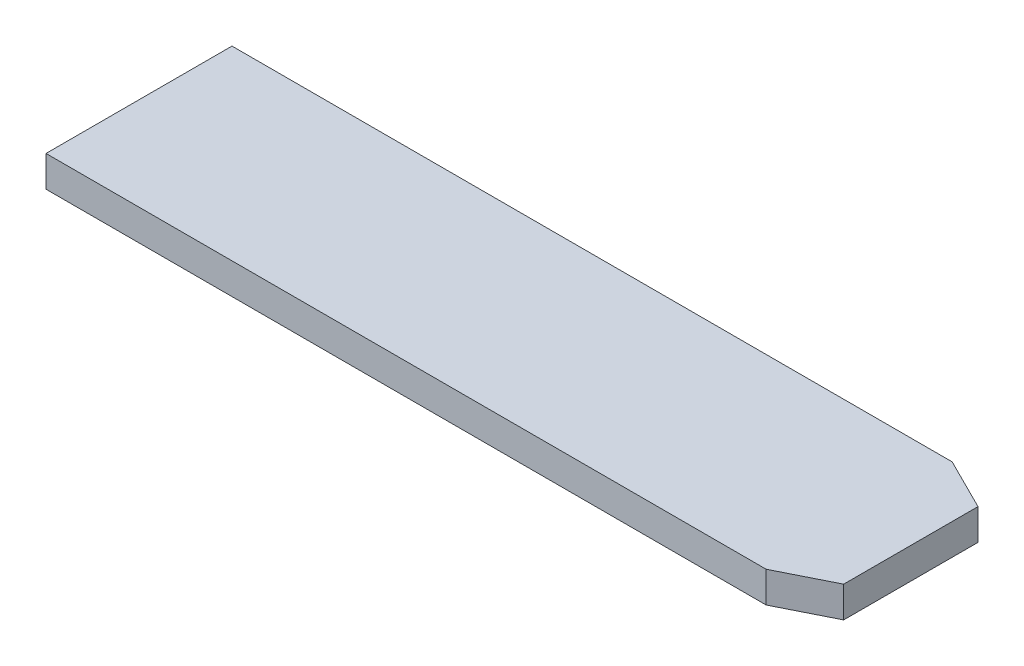
ISO-10303-21;
HEADER;
FILE_DESCRIPTION(('STEP AP214'),'2;1');
FILE_NAME('part.step','',(''),(''),'','','');
FILE_SCHEMA(('AUTOMOTIVE_DESIGN { 1 0 10303 214 1 1 1 1 }'));
ENDSEC;
DATA;
#1=APPLICATION_CONTEXT('core data for automotive mechanical design processes');
#2=APPLICATION_PROTOCOL_DEFINITION('international standard','automotive_design',2000,#1);
#3=PRODUCT_CONTEXT('',#1,'mechanical');
#4=PRODUCT('Part','Part','',(#3));
#5=PRODUCT_RELATED_PRODUCT_CATEGORY('part','',(#4));
#6=PRODUCT_DEFINITION_FORMATION('','',#4);
#7=PRODUCT_DEFINITION_CONTEXT('part definition',#1,'design');
#8=PRODUCT_DEFINITION('design','',#6,#7);
#9=PRODUCT_DEFINITION_SHAPE('','',#8);
#10=(LENGTH_UNIT() NAMED_UNIT(*) SI_UNIT(.MILLI.,.METRE.));
#11=(NAMED_UNIT(*) PLANE_ANGLE_UNIT() SI_UNIT($,.RADIAN.));
#12=(NAMED_UNIT(*) SI_UNIT($,.STERADIAN.) SOLID_ANGLE_UNIT());
#13=UNCERTAINTY_MEASURE_WITH_UNIT(LENGTH_MEASURE(1.E-05),#10,'distance_accuracy_value','');
#14=(GEOMETRIC_REPRESENTATION_CONTEXT(3) GLOBAL_UNCERTAINTY_ASSIGNED_CONTEXT((#13)) GLOBAL_UNIT_ASSIGNED_CONTEXT((#10,
#11,#12)) REPRESENTATION_CONTEXT('',''));
#15=CARTESIAN_POINT('',(0.,0.,0.));
#16=DIRECTION('',(0.,0.,1.));
#17=DIRECTION('',(1.,0.,0.));
#18=AXIS2_PLACEMENT_3D('',#15,#16,#17);
#19=CARTESIAN_POINT('',(-34.85,3.,-9.));
#20=DIRECTION('',(1.,0.,0.));
#21=DIRECTION('',(0.,0.,-1.));
#22=AXIS2_PLACEMENT_3D('',#19,#20,#21);
#23=PLANE('',#22);
#24=DIRECTION('',(0.,0.,1.));
#25=VECTOR('',#24,1.);
#26=CARTESIAN_POINT('',(-34.85,0.,-9.));
#27=LINE('',#26,#25);
#28=CARTESIAN_POINT('',(-34.85,0.,-9.));
#29=VERTEX_POINT('',#28);
#30=CARTESIAN_POINT('',(-34.85,0.,9.));
#31=VERTEX_POINT('',#30);
#32=EDGE_CURVE('E93',#29,#31,#27,.T.);
#33=ORIENTED_EDGE('',*,*,#32,.T.);
#34=DIRECTION('',(0.,-1.,0.));
#35=VECTOR('',#34,1.);
#36=CARTESIAN_POINT('',(-34.85,3.,9.));
#37=LINE('',#36,#35);
#38=CARTESIAN_POINT('',(-34.85,3.,9.));
#39=VERTEX_POINT('',#38);
#40=EDGE_CURVE('E12',#39,#31,#37,.T.);
#41=ORIENTED_EDGE('',*,*,#40,.F.);
#42=DIRECTION('',(0.,0.,1.));
#43=VECTOR('',#42,1.);
#44=CARTESIAN_POINT('',(-34.85,3.,-9.));
#45=LINE('',#44,#43);
#46=CARTESIAN_POINT('',(-34.85,3.,-9.));
#47=VERTEX_POINT('',#46);
#48=EDGE_CURVE('E182',#47,#39,#45,.T.);
#49=ORIENTED_EDGE('',*,*,#48,.F.);
#50=DIRECTION('',(0.,-1.,0.));
#51=VECTOR('',#50,1.);
#52=CARTESIAN_POINT('',(-34.85,3.,-9.));
#53=LINE('',#52,#51);
#54=EDGE_CURVE('E185',#47,#29,#53,.T.);
#55=ORIENTED_EDGE('',*,*,#54,.T.);
#56=EDGE_LOOP('',(#33,#41,#49,#55));
#57=FACE_BOUND('',#56,.T.);
#58=ADVANCED_FACE('F44',(#57),#23,.F.);
#59=CARTESIAN_POINT('',(34.85,3.,8.99999999999999));
#60=DIRECTION('',(0.,0.,-1.));
#61=DIRECTION('',(-1.,0.,0.));
#62=AXIS2_PLACEMENT_3D('',#59,#60,#61);
#63=PLANE('',#62);
#64=DIRECTION('',(1.,0.,0.));
#65=VECTOR('',#64,1.);
#66=CARTESIAN_POINT('',(34.85,0.,8.99999999999999));
#67=LINE('',#66,#65);
#68=CARTESIAN_POINT('',(34.85,0.,8.99999999999999));
#69=VERTEX_POINT('',#68);
#70=EDGE_CURVE('E82',#31,#69,#67,.T.);
#71=ORIENTED_EDGE('',*,*,#70,.T.);
#72=DIRECTION('',(0.,1.,0.));
#73=VECTOR('',#72,1.);
#74=CARTESIAN_POINT('',(34.85,0.,8.99999999999999));
#75=LINE('',#74,#73);
#76=CARTESIAN_POINT('',(34.85,3.,8.99999999999999));
#77=VERTEX_POINT('',#76);
#78=EDGE_CURVE('E53',#77,#69,#75,.F.);
#79=ORIENTED_EDGE('',*,*,#78,.F.);
#80=DIRECTION('',(1.,0.,0.));
#81=VECTOR('',#80,1.);
#82=CARTESIAN_POINT('',(34.85,3.,8.99999999999999));
#83=LINE('',#82,#81);
#84=EDGE_CURVE('E189',#39,#77,#83,.T.);
#85=ORIENTED_EDGE('',*,*,#84,.F.);
#86=ORIENTED_EDGE('',*,*,#40,.T.);
#87=EDGE_LOOP('',(#71,#79,#85,#86));
#88=FACE_BOUND('',#87,.T.);
#89=ADVANCED_FACE('F84',(#88),#63,.F.);
#90=CARTESIAN_POINT('',(34.85,3.,-9.00000000000001));
#91=DIRECTION('',(0.,0.,1.));
#92=DIRECTION('',(1.,0.,0.));
#93=AXIS2_PLACEMENT_3D('',#90,#91,#92);
#94=PLANE('',#93);
#95=DIRECTION('',(-1.,0.,0.));
#96=VECTOR('',#95,1.);
#97=CARTESIAN_POINT('',(34.85,0.,-9.00000000000001));
#98=LINE('',#97,#96);
#99=CARTESIAN_POINT('',(34.85,0.,-9.00000000000001));
#100=VERTEX_POINT('',#99);
#101=EDGE_CURVE('E92',#100,#29,#98,.T.);
#102=ORIENTED_EDGE('',*,*,#101,.T.);
#103=ORIENTED_EDGE('',*,*,#54,.F.);
#104=DIRECTION('',(-1.,0.,0.));
#105=VECTOR('',#104,1.);
#106=CARTESIAN_POINT('',(34.85,3.,-9.00000000000001));
#107=LINE('',#106,#105);
#108=CARTESIAN_POINT('',(34.85,3.,-9.00000000000001));
#109=VERTEX_POINT('',#108);
#110=EDGE_CURVE('E62',#109,#47,#107,.T.);
#111=ORIENTED_EDGE('',*,*,#110,.F.);
#112=DIRECTION('',(0.,1.,0.));
#113=VECTOR('',#112,1.);
#114=CARTESIAN_POINT('',(34.85,3.,-9.00000000000001));
#115=LINE('',#114,#113);
#116=EDGE_CURVE('E47',#109,#100,#115,.F.);
#117=ORIENTED_EDGE('',*,*,#116,.T.);
#118=EDGE_LOOP('',(#102,#103,#111,#117));
#119=FACE_BOUND('',#118,.T.);
#120=ADVANCED_FACE('F184',(#119),#94,.F.);
#121=CARTESIAN_POINT('',(0.,3.,0.));
#122=DIRECTION('',(0.,-1.,0.));
#123=DIRECTION('',(0.,0.,-1.));
#124=AXIS2_PLACEMENT_3D('',#121,#122,#123);
#125=PLANE('',#124);
#126=ORIENTED_EDGE('',*,*,#48,.T.);
#127=ORIENTED_EDGE('',*,*,#84,.T.);
#128=DIRECTION('',(-0.894427190999916,0.,0.447213595499957));
#129=VECTOR('',#128,1.);
#130=CARTESIAN_POINT('',(39.85,3.,6.5));
#131=LINE('',#130,#129);
#132=CARTESIAN_POINT('',(39.85,3.,6.5));
#133=VERTEX_POINT('',#132);
#134=EDGE_CURVE('E102',#133,#77,#131,.T.);
#135=ORIENTED_EDGE('',*,*,#134,.F.);
#136=DIRECTION('',(0.,0.,1.));
#137=VECTOR('',#136,1.);
#138=CARTESIAN_POINT('',(39.85,3.,6.5));
#139=LINE('',#138,#137);
#140=CARTESIAN_POINT('',(39.85,3.,-6.5));
#141=VERTEX_POINT('',#140);
#142=EDGE_CURVE('E170',#141,#133,#139,.T.);
#143=ORIENTED_EDGE('',*,*,#142,.F.);
#144=DIRECTION('',(-0.894427190999915,0.,-0.447213595499959));
#145=VECTOR('',#144,1.);
#146=CARTESIAN_POINT('',(39.85,3.,-6.5));
#147=LINE('',#146,#145);
#148=EDGE_CURVE('E112',#141,#109,#147,.T.);
#149=ORIENTED_EDGE('',*,*,#148,.T.);
#150=ORIENTED_EDGE('',*,*,#110,.T.);
#151=EDGE_LOOP('',(#126,#127,#135,#143,#149,#150));
#152=FACE_BOUND('',#151,.T.);
#153=ADVANCED_FACE('F145',(#152),#125,.F.);
#154=CARTESIAN_POINT('',(0.,0.,0.));
#155=DIRECTION('',(0.,-1.,0.));
#156=DIRECTION('',(0.,0.,-1.));
#157=AXIS2_PLACEMENT_3D('',#154,#155,#156);
#158=PLANE('',#157);
#159=ORIENTED_EDGE('',*,*,#32,.F.);
#160=ORIENTED_EDGE('',*,*,#101,.F.);
#161=DIRECTION('',(-0.894427190999915,0.,-0.447213595499959));
#162=VECTOR('',#161,1.);
#163=CARTESIAN_POINT('',(39.85,0.,-6.5));
#164=LINE('',#163,#162);
#165=CARTESIAN_POINT('',(39.85,0.,-6.5));
#166=VERTEX_POINT('',#165);
#167=EDGE_CURVE('E109',#166,#100,#164,.T.);
#168=ORIENTED_EDGE('',*,*,#167,.F.);
#169=DIRECTION('',(0.,0.,-1.));
#170=VECTOR('',#169,1.);
#171=CARTESIAN_POINT('',(39.85,0.,6.5));
#172=LINE('',#171,#170);
#173=CARTESIAN_POINT('',(39.85,0.,6.5));
#174=VERTEX_POINT('',#173);
#175=EDGE_CURVE('E107',#174,#166,#172,.T.);
#176=ORIENTED_EDGE('',*,*,#175,.F.);
#177=DIRECTION('',(-0.894427190999916,0.,0.447213595499957));
#178=VECTOR('',#177,1.);
#179=CARTESIAN_POINT('',(39.85,0.,6.5));
#180=LINE('',#179,#178);
#181=EDGE_CURVE('E100',#174,#69,#180,.T.);
#182=ORIENTED_EDGE('',*,*,#181,.T.);
#183=ORIENTED_EDGE('',*,*,#70,.F.);
#184=EDGE_LOOP('',(#159,#160,#168,#176,#182,#183));
#185=FACE_BOUND('',#184,.T.);
#186=ADVANCED_FACE('F104',(#185),#158,.T.);
#187=CARTESIAN_POINT('',(39.85,0.,0.));
#188=DIRECTION('',(1.,0.,0.));
#189=DIRECTION('',(0.,0.,-1.));
#190=AXIS2_PLACEMENT_3D('',#187,#188,#189);
#191=PLANE('',#190);
#192=DIRECTION('',(0.,1.,0.));
#193=VECTOR('',#192,1.);
#194=CARTESIAN_POINT('',(39.85,3.,-6.5));
#195=LINE('',#194,#193);
#196=EDGE_CURVE('E162',#166,#141,#195,.T.);
#197=ORIENTED_EDGE('',*,*,#196,.T.);
#198=ORIENTED_EDGE('',*,*,#142,.T.);
#199=DIRECTION('',(0.,-1.,0.));
#200=VECTOR('',#199,1.);
#201=CARTESIAN_POINT('',(39.85,3.,6.5));
#202=LINE('',#201,#200);
#203=EDGE_CURVE('E122',#133,#174,#202,.T.);
#204=ORIENTED_EDGE('',*,*,#203,.T.);
#205=ORIENTED_EDGE('',*,*,#175,.T.);
#206=EDGE_LOOP('',(#197,#198,#204,#205));
#207=FACE_BOUND('',#206,.T.);
#208=ADVANCED_FACE('F139',(#207),#191,.T.);
#209=CARTESIAN_POINT('',(10.57,0.,21.14));
#210=DIRECTION('',(0.447213595499957,0.,0.894427190999916));
#211=DIRECTION('',(0.894427190999916,0.,-0.447213595499957));
#212=AXIS2_PLACEMENT_3D('',#209,#210,#211);
#213=PLANE('',#212);
#214=ORIENTED_EDGE('',*,*,#134,.T.);
#215=ORIENTED_EDGE('',*,*,#78,.T.);
#216=ORIENTED_EDGE('',*,*,#181,.F.);
#217=ORIENTED_EDGE('',*,*,#203,.F.);
#218=EDGE_LOOP('',(#214,#215,#216,#217));
#219=FACE_BOUND('',#218,.T.);
#220=ADVANCED_FACE('F97',(#219),#213,.T.);
#221=CARTESIAN_POINT('',(10.5700000000001,0.,-21.14));
#222=DIRECTION('',(-0.447213595499959,0.,0.894427190999916));
#223=DIRECTION('',(0.894427190999915,0.,0.447213595499959));
#224=AXIS2_PLACEMENT_3D('',#221,#222,#223);
#225=PLANE('',#224);
#226=ORIENTED_EDGE('',*,*,#167,.T.);
#227=ORIENTED_EDGE('',*,*,#116,.F.);
#228=ORIENTED_EDGE('',*,*,#148,.F.);
#229=ORIENTED_EDGE('',*,*,#196,.F.);
#230=EDGE_LOOP('',(#226,#227,#228,#229));
#231=FACE_BOUND('',#230,.T.);
#232=ADVANCED_FACE('F138',(#231),#225,.F.);
#233=CLOSED_SHELL('',(#58,#89,#120,#153,#186,#208,#220,#232));
#234=MANIFOLD_SOLID_BREP('B2',#233);
#235=ADVANCED_BREP_SHAPE_REPRESENTATION('',(#18,#234),#14);
#236=SHAPE_DEFINITION_REPRESENTATION(#9,#235);
ENDSEC;
END-ISO-10303-21;
